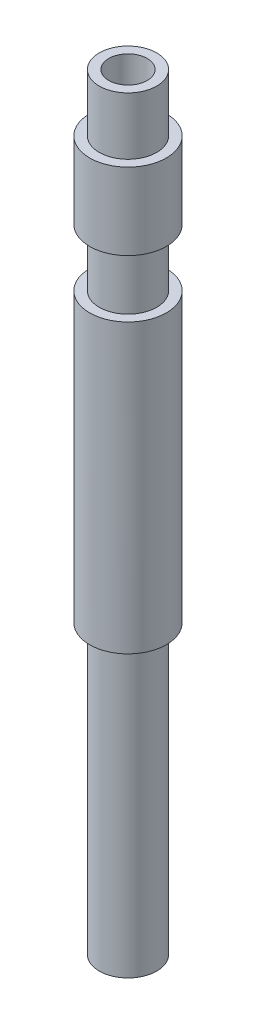
ISO-10303-21;
HEADER;
FILE_DESCRIPTION(('STEP AP214'),'2;1');
FILE_NAME('part.step','',(''),(''),'','','');
FILE_SCHEMA(('AUTOMOTIVE_DESIGN { 1 0 10303 214 1 1 1 1 }'));
ENDSEC;
DATA;
#1=APPLICATION_CONTEXT('core data for automotive mechanical design processes');
#2=APPLICATION_PROTOCOL_DEFINITION('international standard','automotive_design',2000,#1);
#3=PRODUCT_CONTEXT('',#1,'mechanical');
#4=PRODUCT('Part','Part','',(#3));
#5=PRODUCT_RELATED_PRODUCT_CATEGORY('part','',(#4));
#6=PRODUCT_DEFINITION_FORMATION('','',#4);
#7=PRODUCT_DEFINITION_CONTEXT('part definition',#1,'design');
#8=PRODUCT_DEFINITION('design','',#6,#7);
#9=PRODUCT_DEFINITION_SHAPE('','',#8);
#10=(LENGTH_UNIT() NAMED_UNIT(*) SI_UNIT(.MILLI.,.METRE.));
#11=(NAMED_UNIT(*) PLANE_ANGLE_UNIT() SI_UNIT($,.RADIAN.));
#12=(NAMED_UNIT(*) SI_UNIT($,.STERADIAN.) SOLID_ANGLE_UNIT());
#13=UNCERTAINTY_MEASURE_WITH_UNIT(LENGTH_MEASURE(1.E-05),#10,'distance_accuracy_value','');
#14=(GEOMETRIC_REPRESENTATION_CONTEXT(3) GLOBAL_UNCERTAINTY_ASSIGNED_CONTEXT((#13)) GLOBAL_UNIT_ASSIGNED_CONTEXT((#10,
#11,#12)) REPRESENTATION_CONTEXT('',''));
#15=CARTESIAN_POINT('',(0.,0.,0.));
#16=DIRECTION('',(0.,0.,1.));
#17=DIRECTION('',(1.,0.,0.));
#18=AXIS2_PLACEMENT_3D('',#15,#16,#17);
#19=CARTESIAN_POINT('',(0.,0.,0.));
#20=DIRECTION('',(0.,1.,0.));
#21=DIRECTION('',(0.,0.,1.));
#22=AXIS2_PLACEMENT_3D('',#19,#20,#21);
#23=PLANE('',#22);
#24=CARTESIAN_POINT('',(0.,0.,0.));
#25=DIRECTION('',(0.,1.,0.));
#26=DIRECTION('',(0.,0.,1.));
#27=AXIS2_PLACEMENT_3D('',#24,#25,#26);
#28=CIRCLE('',#27,1.);
#29=CARTESIAN_POINT('',(0.,0.,1.));
#30=VERTEX_POINT('',#29);
#31=EDGE_CURVE('E38',#30,#30,#28,.T.);
#32=ORIENTED_EDGE('',*,*,#31,.T.);
#33=EDGE_LOOP('',(#32));
#34=FACE_BOUND('',#33,.T.);
#35=CARTESIAN_POINT('',(0.,0.,0.));
#36=DIRECTION('',(0.,-1.,0.));
#37=DIRECTION('',(0.,0.,-1.));
#38=AXIS2_PLACEMENT_3D('',#35,#36,#37);
#39=CIRCLE('',#38,1.5);
#40=CARTESIAN_POINT('',(0.,0.,-1.5));
#41=VERTEX_POINT('',#40);
#42=EDGE_CURVE('E73',#41,#41,#39,.T.);
#43=ORIENTED_EDGE('',*,*,#42,.T.);
#44=EDGE_LOOP('',(#43));
#45=FACE_BOUND('',#44,.T.);
#46=ADVANCED_FACE('F34',(#34,#45),#23,.F.);
#47=CARTESIAN_POINT('',(0.,40.,0.));
#48=DIRECTION('',(0.,-1.,0.));
#49=DIRECTION('',(0.,0.,-1.));
#50=AXIS2_PLACEMENT_3D('',#47,#48,#49);
#51=CYLINDRICAL_SURFACE('',#50,2.);
#52=CARTESIAN_POINT('',(0.,15.,0.));
#53=DIRECTION('',(0.,-1.,0.));
#54=DIRECTION('',(0.,0.,-1.));
#55=AXIS2_PLACEMENT_3D('',#52,#53,#54);
#56=CIRCLE('',#55,2.);
#57=CARTESIAN_POINT('',(0.,15.,-2.));
#58=VERTEX_POINT('',#57);
#59=EDGE_CURVE('E67',#58,#58,#56,.T.);
#60=ORIENTED_EDGE('',*,*,#59,.F.);
#61=EDGE_LOOP('',(#60));
#62=FACE_BOUND('',#61,.T.);
#63=CARTESIAN_POINT('',(0.,30.,0.));
#64=DIRECTION('',(0.,1.,0.));
#65=DIRECTION('',(0.,0.,1.));
#66=AXIS2_PLACEMENT_3D('',#63,#64,#65);
#67=CIRCLE('',#66,2.0000000000001);
#68=CARTESIAN_POINT('',(0.,30.,2.0000000000001));
#69=VERTEX_POINT('',#68);
#70=EDGE_CURVE('E55',#69,#69,#67,.T.);
#71=ORIENTED_EDGE('',*,*,#70,.F.);
#72=EDGE_LOOP('',(#71));
#73=FACE_BOUND('',#72,.T.);
#74=ADVANCED_FACE('F36',(#62,#73),#51,.T.);
#75=CARTESIAN_POINT('',(0.,37.,0.));
#76=DIRECTION('',(0.,1.,0.));
#77=DIRECTION('',(0.,0.,1.));
#78=AXIS2_PLACEMENT_3D('',#75,#76,#77);
#79=CIRCLE('',#78,2.);
#80=CARTESIAN_POINT('',(0.,37.,2.));
#81=VERTEX_POINT('',#80);
#82=EDGE_CURVE('E45',#81,#81,#79,.T.);
#83=ORIENTED_EDGE('',*,*,#82,.F.);
#84=EDGE_LOOP('',(#83));
#85=FACE_BOUND('',#84,.T.);
#86=CARTESIAN_POINT('',(0.,33.,0.));
#87=DIRECTION('',(0.,1.,0.));
#88=DIRECTION('',(0.,0.,1.));
#89=AXIS2_PLACEMENT_3D('',#86,#87,#88);
#90=CIRCLE('',#89,2.0000000000001);
#91=CARTESIAN_POINT('',(0.,33.,2.0000000000001));
#92=VERTEX_POINT('',#91);
#93=EDGE_CURVE('E64',#92,#92,#90,.T.);
#94=ORIENTED_EDGE('',*,*,#93,.T.);
#95=EDGE_LOOP('',(#94));
#96=FACE_BOUND('',#95,.T.);
#97=ADVANCED_FACE('F93',(#85,#96),#51,.T.);
#98=CARTESIAN_POINT('',(0.,40.,0.));
#99=DIRECTION('',(0.,1.,0.));
#100=DIRECTION('',(0.,0.,1.));
#101=AXIS2_PLACEMENT_3D('',#98,#99,#100);
#102=PLANE('',#101);
#103=CARTESIAN_POINT('',(0.,40.,0.));
#104=DIRECTION('',(0.,1.,0.));
#105=DIRECTION('',(0.,0.,1.));
#106=AXIS2_PLACEMENT_3D('',#103,#104,#105);
#107=CIRCLE('',#106,1.);
#108=CARTESIAN_POINT('',(0.,40.,1.));
#109=VERTEX_POINT('',#108);
#110=EDGE_CURVE('E10',#109,#109,#107,.T.);
#111=ORIENTED_EDGE('',*,*,#110,.F.);
#112=EDGE_LOOP('',(#111));
#113=FACE_BOUND('',#112,.T.);
#114=CARTESIAN_POINT('',(0.,40.,0.));
#115=DIRECTION('',(0.,1.,0.));
#116=DIRECTION('',(0.,0.,1.));
#117=AXIS2_PLACEMENT_3D('',#114,#115,#116);
#118=CIRCLE('',#117,1.5);
#119=CARTESIAN_POINT('',(0.,40.,1.5));
#120=VERTEX_POINT('',#119);
#121=EDGE_CURVE('E52',#120,#120,#118,.T.);
#122=ORIENTED_EDGE('',*,*,#121,.T.);
#123=EDGE_LOOP('',(#122));
#124=FACE_BOUND('',#123,.T.);
#125=ADVANCED_FACE('F115',(#113,#124),#102,.T.);
#126=CARTESIAN_POINT('',(0.,40.,0.));
#127=DIRECTION('',(0.,-1.,0.));
#128=DIRECTION('',(0.,0.,-1.));
#129=AXIS2_PLACEMENT_3D('',#126,#127,#128);
#130=CYLINDRICAL_SURFACE('',#129,1.);
#131=ORIENTED_EDGE('',*,*,#110,.T.);
#132=EDGE_LOOP('',(#131));
#133=FACE_BOUND('',#132,.T.);
#134=ORIENTED_EDGE('',*,*,#31,.F.);
#135=EDGE_LOOP('',(#134));
#136=FACE_BOUND('',#135,.T.);
#137=ADVANCED_FACE('F121',(#133,#136),#130,.F.);
#138=CARTESIAN_POINT('',(2.,37.,0.));
#139=DIRECTION('',(0.,1.,0.));
#140=DIRECTION('',(0.,0.,1.));
#141=AXIS2_PLACEMENT_3D('',#138,#139,#140);
#142=PLANE('',#141);
#143=ORIENTED_EDGE('',*,*,#82,.T.);
#144=EDGE_LOOP('',(#143));
#145=FACE_BOUND('',#144,.T.);
#146=CARTESIAN_POINT('',(0.,37.,0.));
#147=DIRECTION('',(0.,1.,0.));
#148=DIRECTION('',(0.,0.,1.));
#149=AXIS2_PLACEMENT_3D('',#146,#147,#148);
#150=CIRCLE('',#149,1.5);
#151=CARTESIAN_POINT('',(0.,37.,1.5));
#152=VERTEX_POINT('',#151);
#153=EDGE_CURVE('E49',#152,#152,#150,.T.);
#154=ORIENTED_EDGE('',*,*,#153,.F.);
#155=EDGE_LOOP('',(#154));
#156=FACE_BOUND('',#155,.T.);
#157=ADVANCED_FACE('F133',(#145,#156),#142,.T.);
#158=CARTESIAN_POINT('',(0.,40.,0.));
#159=DIRECTION('',(0.,1.,0.));
#160=DIRECTION('',(0.,0.,1.));
#161=AXIS2_PLACEMENT_3D('',#158,#159,#160);
#162=CYLINDRICAL_SURFACE('',#161,1.5);
#163=ORIENTED_EDGE('',*,*,#153,.T.);
#164=EDGE_LOOP('',(#163));
#165=FACE_BOUND('',#164,.T.);
#166=ORIENTED_EDGE('',*,*,#121,.F.);
#167=EDGE_LOOP('',(#166));
#168=FACE_BOUND('',#167,.T.);
#169=ADVANCED_FACE('F100',(#165,#168),#162,.T.);
#170=CARTESIAN_POINT('',(2.0000000000001,30.,0.));
#171=DIRECTION('',(0.,1.,0.));
#172=DIRECTION('',(0.,0.,1.));
#173=AXIS2_PLACEMENT_3D('',#170,#171,#172);
#174=PLANE('',#173);
#175=ORIENTED_EDGE('',*,*,#70,.T.);
#176=EDGE_LOOP('',(#175));
#177=FACE_BOUND('',#176,.T.);
#178=CARTESIAN_POINT('',(0.,30.,0.));
#179=DIRECTION('',(0.,1.,0.));
#180=DIRECTION('',(0.,0.,1.));
#181=AXIS2_PLACEMENT_3D('',#178,#179,#180);
#182=CIRCLE('',#181,1.5000000000001);
#183=CARTESIAN_POINT('',(0.,30.,1.5000000000001));
#184=VERTEX_POINT('',#183);
#185=EDGE_CURVE('E58',#184,#184,#182,.T.);
#186=ORIENTED_EDGE('',*,*,#185,.F.);
#187=EDGE_LOOP('',(#186));
#188=FACE_BOUND('',#187,.T.);
#189=ADVANCED_FACE('F96',(#177,#188),#174,.T.);
#190=CARTESIAN_POINT('',(0.,40.,0.));
#191=DIRECTION('',(0.,1.,0.));
#192=DIRECTION('',(0.,0.,1.));
#193=AXIS2_PLACEMENT_3D('',#190,#191,#192);
#194=CYLINDRICAL_SURFACE('',#193,1.5000000000001);
#195=ORIENTED_EDGE('',*,*,#185,.T.);
#196=EDGE_LOOP('',(#195));
#197=FACE_BOUND('',#196,.T.);
#198=CARTESIAN_POINT('',(0.,33.,0.));
#199=DIRECTION('',(0.,1.,0.));
#200=DIRECTION('',(0.,0.,1.));
#201=AXIS2_PLACEMENT_3D('',#198,#199,#200);
#202=CIRCLE('',#201,1.5000000000001);
#203=CARTESIAN_POINT('',(0.,33.,1.5000000000001));
#204=VERTEX_POINT('',#203);
#205=EDGE_CURVE('E61',#204,#204,#202,.T.);
#206=ORIENTED_EDGE('',*,*,#205,.F.);
#207=EDGE_LOOP('',(#206));
#208=FACE_BOUND('',#207,.T.);
#209=ADVANCED_FACE('F99',(#197,#208),#194,.T.);
#210=CARTESIAN_POINT('',(2.0000000000001,33.,0.));
#211=DIRECTION('',(0.,-1.,0.));
#212=DIRECTION('',(0.,0.,-1.));
#213=AXIS2_PLACEMENT_3D('',#210,#211,#212);
#214=PLANE('',#213);
#215=ORIENTED_EDGE('',*,*,#205,.T.);
#216=EDGE_LOOP('',(#215));
#217=FACE_BOUND('',#216,.T.);
#218=ORIENTED_EDGE('',*,*,#93,.F.);
#219=EDGE_LOOP('',(#218));
#220=FACE_BOUND('',#219,.T.);
#221=ADVANCED_FACE('F87',(#217,#220),#214,.T.);
#222=CARTESIAN_POINT('',(2.,15.,0.));
#223=DIRECTION('',(0.,1.,0.));
#224=DIRECTION('',(0.,0.,1.));
#225=AXIS2_PLACEMENT_3D('',#222,#223,#224);
#226=PLANE('',#225);
#227=CARTESIAN_POINT('',(0.,15.,0.));
#228=DIRECTION('',(0.,-1.,0.));
#229=DIRECTION('',(0.,0.,-1.));
#230=AXIS2_PLACEMENT_3D('',#227,#228,#229);
#231=CIRCLE('',#230,1.5);
#232=CARTESIAN_POINT('',(0.,15.,-1.5));
#233=VERTEX_POINT('',#232);
#234=EDGE_CURVE('E70',#233,#233,#231,.T.);
#235=ORIENTED_EDGE('',*,*,#234,.F.);
#236=EDGE_LOOP('',(#235));
#237=FACE_BOUND('',#236,.T.);
#238=ORIENTED_EDGE('',*,*,#59,.T.);
#239=EDGE_LOOP('',(#238));
#240=FACE_BOUND('',#239,.T.);
#241=ADVANCED_FACE('F81',(#237,#240),#226,.F.);
#242=CARTESIAN_POINT('',(0.,0.,0.));
#243=DIRECTION('',(0.,-1.,0.));
#244=DIRECTION('',(0.,0.,-1.));
#245=AXIS2_PLACEMENT_3D('',#242,#243,#244);
#246=CYLINDRICAL_SURFACE('',#245,1.5);
#247=ORIENTED_EDGE('',*,*,#42,.F.);
#248=EDGE_LOOP('',(#247));
#249=FACE_BOUND('',#248,.T.);
#250=ORIENTED_EDGE('',*,*,#234,.T.);
#251=EDGE_LOOP('',(#250));
#252=FACE_BOUND('',#251,.T.);
#253=ADVANCED_FACE('F78',(#249,#252),#246,.T.);
#254=CLOSED_SHELL('',(#46,#74,#97,#125,#137,#157,#169,#189,#209,#221,#241,#253));
#255=MANIFOLD_SOLID_BREP('B2',#254);
#256=ADVANCED_BREP_SHAPE_REPRESENTATION('',(#18,#255),#14);
#257=SHAPE_DEFINITION_REPRESENTATION(#9,#256);
ENDSEC;
END-ISO-10303-21;
